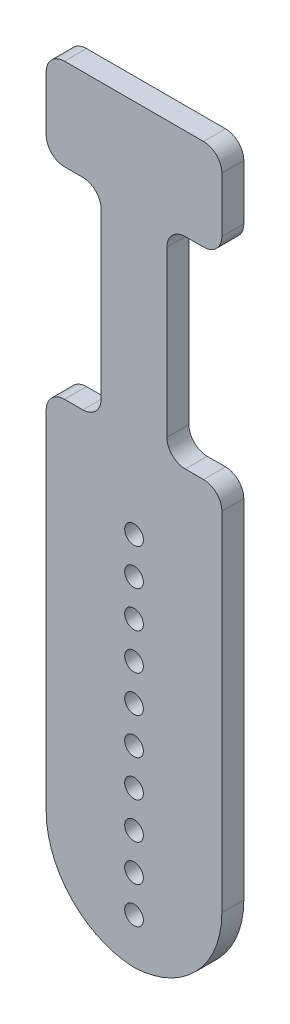
ISO-10303-21;
HEADER;
FILE_DESCRIPTION(('STEP AP214'),'2;1');
FILE_NAME('part.step','',(''),(''),'','','');
FILE_SCHEMA(('AUTOMOTIVE_DESIGN { 1 0 10303 214 1 1 1 1 }'));
ENDSEC;
DATA;
#1=APPLICATION_CONTEXT('core data for automotive mechanical design processes');
#2=APPLICATION_PROTOCOL_DEFINITION('international standard','automotive_design',2000,#1);
#3=PRODUCT_CONTEXT('',#1,'mechanical');
#4=PRODUCT('Part','Part','',(#3));
#5=PRODUCT_RELATED_PRODUCT_CATEGORY('part','',(#4));
#6=PRODUCT_DEFINITION_FORMATION('','',#4);
#7=PRODUCT_DEFINITION_CONTEXT('part definition',#1,'design');
#8=PRODUCT_DEFINITION('design','',#6,#7);
#9=PRODUCT_DEFINITION_SHAPE('','',#8);
#10=(LENGTH_UNIT() NAMED_UNIT(*) SI_UNIT(.MILLI.,.METRE.));
#11=(NAMED_UNIT(*) PLANE_ANGLE_UNIT() SI_UNIT($,.RADIAN.));
#12=(NAMED_UNIT(*) SI_UNIT($,.STERADIAN.) SOLID_ANGLE_UNIT());
#13=UNCERTAINTY_MEASURE_WITH_UNIT(LENGTH_MEASURE(1.E-05),#10,'distance_accuracy_value','');
#14=(GEOMETRIC_REPRESENTATION_CONTEXT(3) GLOBAL_UNCERTAINTY_ASSIGNED_CONTEXT((#13)) GLOBAL_UNIT_ASSIGNED_CONTEXT((#10,
#11,#12)) REPRESENTATION_CONTEXT('',''));
#15=CARTESIAN_POINT('',(0.,0.,0.));
#16=DIRECTION('',(0.,0.,1.));
#17=DIRECTION('',(1.,0.,0.));
#18=AXIS2_PLACEMENT_3D('',#15,#16,#17);
#19=CARTESIAN_POINT('',(24.,205.,-3.));
#20=DIRECTION('',(-1.,0.,0.));
#21=DIRECTION('',(0.,0.,1.));
#22=AXIS2_PLACEMENT_3D('',#19,#20,#21);
#23=PLANE('',#22);
#24=DIRECTION('',(0.,-1.,0.));
#25=VECTOR('',#24,1.);
#26=CARTESIAN_POINT('',(24.,205.,3.));
#27=LINE('',#26,#25);
#28=CARTESIAN_POINT('',(24.,200.,3.));
#29=VERTEX_POINT('',#28);
#30=CARTESIAN_POINT('',(24.,185.,3.));
#31=VERTEX_POINT('',#30);
#32=EDGE_CURVE('E211',#29,#31,#27,.T.);
#33=ORIENTED_EDGE('',*,*,#32,.T.);
#34=DIRECTION('',(0.,0.,1.));
#35=VECTOR('',#34,1.);
#36=CARTESIAN_POINT('',(24.,185.,-3.));
#37=LINE('',#36,#35);
#38=CARTESIAN_POINT('',(24.,185.,-3.));
#39=VERTEX_POINT('',#38);
#40=EDGE_CURVE('E410',#31,#39,#37,.F.);
#41=ORIENTED_EDGE('',*,*,#40,.T.);
#42=DIRECTION('',(0.,-1.,0.));
#43=VECTOR('',#42,1.);
#44=CARTESIAN_POINT('',(24.,205.,-3.));
#45=LINE('',#44,#43);
#46=CARTESIAN_POINT('',(24.,200.,-3.));
#47=VERTEX_POINT('',#46);
#48=EDGE_CURVE('E230',#47,#39,#45,.T.);
#49=ORIENTED_EDGE('',*,*,#48,.F.);
#50=DIRECTION('',(0.,0.,-1.));
#51=VECTOR('',#50,1.);
#52=CARTESIAN_POINT('',(24.,200.,3.));
#53=LINE('',#52,#51);
#54=EDGE_CURVE('E407',#47,#29,#53,.F.);
#55=ORIENTED_EDGE('',*,*,#54,.T.);
#56=EDGE_LOOP('',(#33,#41,#49,#55));
#57=FACE_BOUND('',#56,.T.);
#58=ADVANCED_FACE('F42',(#57),#23,.F.);
#59=CARTESIAN_POINT('',(-24.,205.,-3.));
#60=DIRECTION('',(0.,0.,1.));
#61=DIRECTION('',(1.,0.,0.));
#62=AXIS2_PLACEMENT_3D('',#59,#60,#61);
#63=PLANE('',#62);
#64=CARTESIAN_POINT('',(0.,102.5,-3.));
#65=DIRECTION('',(0.,0.,1.));
#66=DIRECTION('',(1.,0.,0.));
#67=AXIS2_PLACEMENT_3D('',#64,#65,#66);
#68=CIRCLE('',#67,2.55);
#69=CARTESIAN_POINT('',(2.55,102.5,-3.));
#70=VERTEX_POINT('',#69);
#71=EDGE_CURVE('E301',#70,#70,#68,.T.);
#72=ORIENTED_EDGE('',*,*,#71,.T.);
#73=EDGE_LOOP('',(#72));
#74=FACE_BOUND('',#73,.T.);
#75=CARTESIAN_POINT('',(0.,92.5,-3.));
#76=DIRECTION('',(0.,0.,1.));
#77=DIRECTION('',(1.,0.,0.));
#78=AXIS2_PLACEMENT_3D('',#75,#76,#77);
#79=CIRCLE('',#78,2.55);
#80=CARTESIAN_POINT('',(2.55,92.5,-3.));
#81=VERTEX_POINT('',#80);
#82=EDGE_CURVE('E293',#81,#81,#79,.T.);
#83=ORIENTED_EDGE('',*,*,#82,.T.);
#84=EDGE_LOOP('',(#83));
#85=FACE_BOUND('',#84,.T.);
#86=CARTESIAN_POINT('',(0.,82.5,-3.));
#87=DIRECTION('',(0.,0.,1.));
#88=DIRECTION('',(1.,0.,0.));
#89=AXIS2_PLACEMENT_3D('',#86,#87,#88);
#90=CIRCLE('',#89,2.55);
#91=CARTESIAN_POINT('',(2.55,82.5,-3.));
#92=VERTEX_POINT('',#91);
#93=EDGE_CURVE('E285',#92,#92,#90,.T.);
#94=ORIENTED_EDGE('',*,*,#93,.T.);
#95=EDGE_LOOP('',(#94));
#96=FACE_BOUND('',#95,.T.);
#97=CARTESIAN_POINT('',(0.,72.5,-3.));
#98=DIRECTION('',(0.,0.,1.));
#99=DIRECTION('',(1.,0.,0.));
#100=AXIS2_PLACEMENT_3D('',#97,#98,#99);
#101=CIRCLE('',#100,2.55);
#102=CARTESIAN_POINT('',(2.55,72.5,-3.));
#103=VERTEX_POINT('',#102);
#104=EDGE_CURVE('E277',#103,#103,#101,.T.);
#105=ORIENTED_EDGE('',*,*,#104,.T.);
#106=EDGE_LOOP('',(#105));
#107=FACE_BOUND('',#106,.T.);
#108=CARTESIAN_POINT('',(0.,62.5,-3.));
#109=DIRECTION('',(0.,0.,1.));
#110=DIRECTION('',(1.,0.,0.));
#111=AXIS2_PLACEMENT_3D('',#108,#109,#110);
#112=CIRCLE('',#111,2.55);
#113=CARTESIAN_POINT('',(2.55,62.5,-3.));
#114=VERTEX_POINT('',#113);
#115=EDGE_CURVE('E269',#114,#114,#112,.T.);
#116=ORIENTED_EDGE('',*,*,#115,.T.);
#117=EDGE_LOOP('',(#116));
#118=FACE_BOUND('',#117,.T.);
#119=CARTESIAN_POINT('',(0.,52.5,-3.));
#120=DIRECTION('',(0.,0.,1.));
#121=DIRECTION('',(1.,0.,0.));
#122=AXIS2_PLACEMENT_3D('',#119,#120,#121);
#123=CIRCLE('',#122,2.55);
#124=CARTESIAN_POINT('',(2.55,52.5,-3.));
#125=VERTEX_POINT('',#124);
#126=EDGE_CURVE('E261',#125,#125,#123,.T.);
#127=ORIENTED_EDGE('',*,*,#126,.T.);
#128=EDGE_LOOP('',(#127));
#129=FACE_BOUND('',#128,.T.);
#130=CARTESIAN_POINT('',(0.,42.5,-3.));
#131=DIRECTION('',(0.,0.,1.));
#132=DIRECTION('',(1.,0.,0.));
#133=AXIS2_PLACEMENT_3D('',#130,#131,#132);
#134=CIRCLE('',#133,2.55);
#135=CARTESIAN_POINT('',(2.55,42.5,-3.));
#136=VERTEX_POINT('',#135);
#137=EDGE_CURVE('E249',#136,#136,#134,.T.);
#138=ORIENTED_EDGE('',*,*,#137,.T.);
#139=EDGE_LOOP('',(#138));
#140=FACE_BOUND('',#139,.T.);
#141=CARTESIAN_POINT('',(0.,12.5,-3.));
#142=DIRECTION('',(0.,0.,1.));
#143=DIRECTION('',(1.,0.,0.));
#144=AXIS2_PLACEMENT_3D('',#141,#142,#143);
#145=CIRCLE('',#144,2.55);
#146=CARTESIAN_POINT('',(2.55,12.5,-3.));
#147=VERTEX_POINT('',#146);
#148=EDGE_CURVE('E253',#147,#147,#145,.T.);
#149=ORIENTED_EDGE('',*,*,#148,.T.);
#150=EDGE_LOOP('',(#149));
#151=FACE_BOUND('',#150,.T.);
#152=CARTESIAN_POINT('',(0.,32.5,-3.));
#153=DIRECTION('',(0.,0.,1.));
#154=DIRECTION('',(1.,0.,0.));
#155=AXIS2_PLACEMENT_3D('',#152,#153,#154);
#156=CIRCLE('',#155,2.55);
#157=CARTESIAN_POINT('',(2.55,32.5,-3.));
#158=VERTEX_POINT('',#157);
#159=EDGE_CURVE('E491',#158,#158,#156,.T.);
#160=ORIENTED_EDGE('',*,*,#159,.T.);
#161=EDGE_LOOP('',(#160));
#162=FACE_BOUND('',#161,.T.);
#163=CARTESIAN_POINT('',(0.,22.5,-3.));
#164=DIRECTION('',(0.,0.,1.));
#165=DIRECTION('',(1.,0.,0.));
#166=AXIS2_PLACEMENT_3D('',#163,#164,#165);
#167=CIRCLE('',#166,2.55);
#168=CARTESIAN_POINT('',(2.55,22.5,-3.));
#169=VERTEX_POINT('',#168);
#170=EDGE_CURVE('E459',#169,#169,#167,.T.);
#171=ORIENTED_EDGE('',*,*,#170,.T.);
#172=EDGE_LOOP('',(#171));
#173=FACE_BOUND('',#172,.T.);
#174=DIRECTION('',(0.,-1.,0.));
#175=VECTOR('',#174,1.);
#176=CARTESIAN_POINT('',(-24.,205.,-3.));
#177=LINE('',#176,#175);
#178=CARTESIAN_POINT('',(-24.,120.,-3.));
#179=VERTEX_POINT('',#178);
#180=CARTESIAN_POINT('',(-24.,25.,-3.));
#181=VERTEX_POINT('',#180);
#182=EDGE_CURVE('E227',#179,#181,#177,.T.);
#183=ORIENTED_EDGE('',*,*,#182,.F.);
#184=CARTESIAN_POINT('',(-19.,120.,-3.));
#185=DIRECTION('',(0.,0.,1.));
#186=DIRECTION('',(1.,0.,0.));
#187=AXIS2_PLACEMENT_3D('',#184,#185,#186);
#188=CIRCLE('',#187,5.);
#189=CARTESIAN_POINT('',(-19.,125.,-3.));
#190=VERTEX_POINT('',#189);
#191=EDGE_CURVE('E351',#179,#190,#188,.F.);
#192=ORIENTED_EDGE('',*,*,#191,.T.);
#193=DIRECTION('',(-1.,0.,0.));
#194=VECTOR('',#193,1.);
#195=CARTESIAN_POINT('',(0.,125.,-3.));
#196=LINE('',#195,#194);
#197=CARTESIAN_POINT('',(-14.,125.,-3.));
#198=VERTEX_POINT('',#197);
#199=EDGE_CURVE('E461',#198,#190,#196,.T.);
#200=ORIENTED_EDGE('',*,*,#199,.F.);
#201=CARTESIAN_POINT('',(-14.,130.,-3.));
#202=DIRECTION('',(0.,0.,1.));
#203=DIRECTION('',(1.,0.,0.));
#204=AXIS2_PLACEMENT_3D('',#201,#202,#203);
#205=CIRCLE('',#204,5.);
#206=CARTESIAN_POINT('',(-8.99999999999999,130.,-3.));
#207=VERTEX_POINT('',#206);
#208=EDGE_CURVE('E58',#198,#207,#205,.T.);
#209=ORIENTED_EDGE('',*,*,#208,.T.);
#210=DIRECTION('',(0.,-1.,0.));
#211=VECTOR('',#210,1.);
#212=CARTESIAN_POINT('',(-8.99999999999997,0.,-3.));
#213=LINE('',#212,#211);
#214=CARTESIAN_POINT('',(-8.99999999999999,175.,-3.));
#215=VERTEX_POINT('',#214);
#216=EDGE_CURVE('E449',#215,#207,#213,.T.);
#217=ORIENTED_EDGE('',*,*,#216,.F.);
#218=CARTESIAN_POINT('',(-14.,175.,-3.));
#219=DIRECTION('',(0.,0.,1.));
#220=DIRECTION('',(1.,0.,0.));
#221=AXIS2_PLACEMENT_3D('',#218,#219,#220);
#222=CIRCLE('',#221,5.);
#223=CARTESIAN_POINT('',(-14.,180.,-3.));
#224=VERTEX_POINT('',#223);
#225=EDGE_CURVE('E12',#215,#224,#222,.T.);
#226=ORIENTED_EDGE('',*,*,#225,.T.);
#227=DIRECTION('',(1.,0.,0.));
#228=VECTOR('',#227,1.);
#229=CARTESIAN_POINT('',(0.,180.,-3.));
#230=LINE('',#229,#228);
#231=CARTESIAN_POINT('',(-19.,180.,-3.));
#232=VERTEX_POINT('',#231);
#233=EDGE_CURVE('E447',#232,#224,#230,.T.);
#234=ORIENTED_EDGE('',*,*,#233,.F.);
#235=CARTESIAN_POINT('',(-19.,185.,-3.));
#236=DIRECTION('',(0.,0.,1.));
#237=DIRECTION('',(1.,0.,0.));
#238=AXIS2_PLACEMENT_3D('',#235,#236,#237);
#239=CIRCLE('',#238,5.);
#240=CARTESIAN_POINT('',(-24.,185.,-3.));
#241=VERTEX_POINT('',#240);
#242=EDGE_CURVE('E342',#232,#241,#239,.F.);
#243=ORIENTED_EDGE('',*,*,#242,.T.);
#244=CARTESIAN_POINT('',(-24.,200.,-3.));
#245=VERTEX_POINT('',#244);
#246=EDGE_CURVE('E519',#245,#241,#177,.T.);
#247=ORIENTED_EDGE('',*,*,#246,.F.);
#248=CARTESIAN_POINT('',(-19.,200.,-3.));
#249=DIRECTION('',(0.,0.,1.));
#250=DIRECTION('',(1.,0.,0.));
#251=AXIS2_PLACEMENT_3D('',#248,#249,#250);
#252=CIRCLE('',#251,5.);
#253=CARTESIAN_POINT('',(-19.,205.,-3.));
#254=VERTEX_POINT('',#253);
#255=EDGE_CURVE('E345',#245,#254,#252,.F.);
#256=ORIENTED_EDGE('',*,*,#255,.T.);
#257=DIRECTION('',(-1.,0.,0.));
#258=VECTOR('',#257,1.);
#259=CARTESIAN_POINT('',(-24.,205.,-3.));
#260=LINE('',#259,#258);
#261=CARTESIAN_POINT('',(19.,205.,-3.));
#262=VERTEX_POINT('',#261);
#263=EDGE_CURVE('E252',#262,#254,#260,.T.);
#264=ORIENTED_EDGE('',*,*,#263,.F.);
#265=CARTESIAN_POINT('',(19.,200.,-3.));
#266=DIRECTION('',(0.,0.,1.));
#267=DIRECTION('',(1.,0.,0.));
#268=AXIS2_PLACEMENT_3D('',#265,#266,#267);
#269=CIRCLE('',#268,5.);
#270=EDGE_CURVE('E336',#262,#47,#269,.F.);
#271=ORIENTED_EDGE('',*,*,#270,.T.);
#272=ORIENTED_EDGE('',*,*,#48,.T.);
#273=CARTESIAN_POINT('',(19.,185.,-3.));
#274=DIRECTION('',(0.,0.,1.));
#275=DIRECTION('',(1.,0.,0.));
#276=AXIS2_PLACEMENT_3D('',#273,#274,#275);
#277=CIRCLE('',#276,5.);
#278=CARTESIAN_POINT('',(19.,180.,-3.));
#279=VERTEX_POINT('',#278);
#280=EDGE_CURVE('E339',#39,#279,#277,.F.);
#281=ORIENTED_EDGE('',*,*,#280,.T.);
#282=DIRECTION('',(1.,0.,0.));
#283=VECTOR('',#282,1.);
#284=CARTESIAN_POINT('',(0.,180.,-3.));
#285=LINE('',#284,#283);
#286=CARTESIAN_POINT('',(14.,180.,-3.));
#287=VERTEX_POINT('',#286);
#288=EDGE_CURVE('E481',#287,#279,#285,.T.);
#289=ORIENTED_EDGE('',*,*,#288,.F.);
#290=CARTESIAN_POINT('',(14.,175.,-3.));
#291=DIRECTION('',(0.,0.,1.));
#292=DIRECTION('',(1.,0.,0.));
#293=AXIS2_PLACEMENT_3D('',#290,#291,#292);
#294=CIRCLE('',#293,5.);
#295=CARTESIAN_POINT('',(9.00000000000001,175.,-3.));
#296=VERTEX_POINT('',#295);
#297=EDGE_CURVE('E427',#287,#296,#294,.T.);
#298=ORIENTED_EDGE('',*,*,#297,.T.);
#299=DIRECTION('',(0.,-1.,0.));
#300=VECTOR('',#299,1.);
#301=CARTESIAN_POINT('',(9.00000000000003,0.,-3.));
#302=LINE('',#301,#300);
#303=CARTESIAN_POINT('',(9.00000000000001,130.,-3.));
#304=VERTEX_POINT('',#303);
#305=EDGE_CURVE('E485',#296,#304,#302,.T.);
#306=ORIENTED_EDGE('',*,*,#305,.T.);
#307=CARTESIAN_POINT('',(14.,130.,-3.));
#308=DIRECTION('',(0.,0.,1.));
#309=DIRECTION('',(1.,0.,0.));
#310=AXIS2_PLACEMENT_3D('',#307,#308,#309);
#311=CIRCLE('',#310,5.);
#312=CARTESIAN_POINT('',(14.,125.,-3.));
#313=VERTEX_POINT('',#312);
#314=EDGE_CURVE('E421',#304,#313,#311,.T.);
#315=ORIENTED_EDGE('',*,*,#314,.T.);
#316=DIRECTION('',(1.,0.,0.));
#317=VECTOR('',#316,1.);
#318=CARTESIAN_POINT('',(0.,125.,-3.));
#319=LINE('',#318,#317);
#320=CARTESIAN_POINT('',(19.,125.,-3.));
#321=VERTEX_POINT('',#320);
#322=EDGE_CURVE('E477',#313,#321,#319,.T.);
#323=ORIENTED_EDGE('',*,*,#322,.T.);
#324=CARTESIAN_POINT('',(19.,120.,-3.));
#325=DIRECTION('',(0.,0.,1.));
#326=DIRECTION('',(1.,0.,0.));
#327=AXIS2_PLACEMENT_3D('',#324,#325,#326);
#328=CIRCLE('',#327,5.);
#329=CARTESIAN_POINT('',(24.,120.,-3.));
#330=VERTEX_POINT('',#329);
#331=EDGE_CURVE('E348',#321,#330,#328,.F.);
#332=ORIENTED_EDGE('',*,*,#331,.T.);
#333=CARTESIAN_POINT('',(24.,25.,-3.));
#334=VERTEX_POINT('',#333);
#335=EDGE_CURVE('E236',#330,#334,#45,.T.);
#336=ORIENTED_EDGE('',*,*,#335,.T.);
#337=CARTESIAN_POINT('',(-1.,25.,-3.));
#338=DIRECTION('',(0.,0.,1.));
#339=DIRECTION('',(1.,0.,0.));
#340=AXIS2_PLACEMENT_3D('',#337,#338,#339);
#341=CIRCLE('',#340,25.);
#342=CARTESIAN_POINT('',(0.,0.0200080064064016,-3.));
#343=VERTEX_POINT('',#342);
#344=EDGE_CURVE('E222',#334,#343,#341,.F.);
#345=ORIENTED_EDGE('',*,*,#344,.T.);
#346=CARTESIAN_POINT('',(0.999999999999994,25.,-3.));
#347=DIRECTION('',(0.,0.,1.));
#348=DIRECTION('',(1.,0.,0.));
#349=AXIS2_PLACEMENT_3D('',#346,#347,#348);
#350=CIRCLE('',#349,25.);
#351=EDGE_CURVE('E242',#343,#181,#350,.F.);
#352=ORIENTED_EDGE('',*,*,#351,.T.);
#353=EDGE_LOOP('',(#183,#192,#200,#209,#217,#226,#234,#243,#247,#256,#264,#271,#272,#281,#289,
#298,#306,#315,#323,#332,#336,#345,#352));
#354=FACE_BOUND('',#353,.T.);
#355=ADVANCED_FACE('F446',(#74,#85,#96,#107,#118,#129,#140,#151,#162,#173,#354),#63,.F.);
#356=CARTESIAN_POINT('',(-24.,205.,-3.));
#357=DIRECTION('',(1.,0.,0.));
#358=DIRECTION('',(0.,0.,-1.));
#359=AXIS2_PLACEMENT_3D('',#356,#357,#358);
#360=PLANE('',#359);
#361=DIRECTION('',(0.,-1.,0.));
#362=VECTOR('',#361,1.);
#363=CARTESIAN_POINT('',(-24.,205.,3.));
#364=LINE('',#363,#362);
#365=CARTESIAN_POINT('',(-24.,200.,3.));
#366=VERTEX_POINT('',#365);
#367=CARTESIAN_POINT('',(-24.,185.,3.));
#368=VERTEX_POINT('',#367);
#369=EDGE_CURVE('E210',#366,#368,#364,.T.);
#370=ORIENTED_EDGE('',*,*,#369,.F.);
#371=DIRECTION('',(0.,0.,1.));
#372=VECTOR('',#371,1.);
#373=CARTESIAN_POINT('',(-24.,200.,-3.));
#374=LINE('',#373,#372);
#375=EDGE_CURVE('E404',#366,#245,#374,.F.);
#376=ORIENTED_EDGE('',*,*,#375,.T.);
#377=ORIENTED_EDGE('',*,*,#246,.T.);
#378=DIRECTION('',(0.,0.,1.));
#379=VECTOR('',#378,1.);
#380=CARTESIAN_POINT('',(-24.,185.,3.));
#381=LINE('',#380,#379);
#382=EDGE_CURVE('E400',#241,#368,#381,.T.);
#383=ORIENTED_EDGE('',*,*,#382,.T.);
#384=EDGE_LOOP('',(#370,#376,#377,#383));
#385=FACE_BOUND('',#384,.T.);
#386=ADVANCED_FACE('F585',(#385),#360,.F.);
#387=CARTESIAN_POINT('',(-24.,120.,3.));
#388=VERTEX_POINT('',#387);
#389=CARTESIAN_POINT('',(-24.,25.,3.));
#390=VERTEX_POINT('',#389);
#391=EDGE_CURVE('E198',#388,#390,#364,.T.);
#392=ORIENTED_EDGE('',*,*,#391,.F.);
#393=DIRECTION('',(0.,0.,1.));
#394=VECTOR('',#393,1.);
#395=CARTESIAN_POINT('',(-24.,120.,-3.));
#396=LINE('',#395,#394);
#397=EDGE_CURVE('E333',#388,#179,#396,.F.);
#398=ORIENTED_EDGE('',*,*,#397,.T.);
#399=ORIENTED_EDGE('',*,*,#182,.T.);
#400=DIRECTION('',(0.,0.,1.));
#401=VECTOR('',#400,1.);
#402=CARTESIAN_POINT('',(-24.,25.,-3.));
#403=LINE('',#402,#401);
#404=EDGE_CURVE('E218',#181,#390,#403,.T.);
#405=ORIENTED_EDGE('',*,*,#404,.T.);
#406=EDGE_LOOP('',(#392,#398,#399,#405));
#407=FACE_BOUND('',#406,.T.);
#408=ADVANCED_FACE('F225',(#407),#360,.F.);
#409=CARTESIAN_POINT('',(-24.,205.,3.));
#410=DIRECTION('',(0.,0.,-1.));
#411=DIRECTION('',(-1.,0.,0.));
#412=AXIS2_PLACEMENT_3D('',#409,#410,#411);
#413=PLANE('',#412);
#414=CARTESIAN_POINT('',(0.,102.5,3.));
#415=DIRECTION('',(0.,0.,1.));
#416=DIRECTION('',(1.,0.,0.));
#417=AXIS2_PLACEMENT_3D('',#414,#415,#416);
#418=CIRCLE('',#417,2.55);
#419=CARTESIAN_POINT('',(2.55,102.5,3.));
#420=VERTEX_POINT('',#419);
#421=EDGE_CURVE('E305',#420,#420,#418,.T.);
#422=ORIENTED_EDGE('',*,*,#421,.F.);
#423=EDGE_LOOP('',(#422));
#424=FACE_BOUND('',#423,.T.);
#425=CARTESIAN_POINT('',(0.,92.5,3.));
#426=DIRECTION('',(0.,0.,1.));
#427=DIRECTION('',(1.,0.,0.));
#428=AXIS2_PLACEMENT_3D('',#425,#426,#427);
#429=CIRCLE('',#428,2.55);
#430=CARTESIAN_POINT('',(2.55,92.5,3.));
#431=VERTEX_POINT('',#430);
#432=EDGE_CURVE('E297',#431,#431,#429,.T.);
#433=ORIENTED_EDGE('',*,*,#432,.F.);
#434=EDGE_LOOP('',(#433));
#435=FACE_BOUND('',#434,.T.);
#436=CARTESIAN_POINT('',(0.,82.5,3.));
#437=DIRECTION('',(0.,0.,1.));
#438=DIRECTION('',(1.,0.,0.));
#439=AXIS2_PLACEMENT_3D('',#436,#437,#438);
#440=CIRCLE('',#439,2.55);
#441=CARTESIAN_POINT('',(2.55,82.5,3.));
#442=VERTEX_POINT('',#441);
#443=EDGE_CURVE('E289',#442,#442,#440,.T.);
#444=ORIENTED_EDGE('',*,*,#443,.F.);
#445=EDGE_LOOP('',(#444));
#446=FACE_BOUND('',#445,.T.);
#447=CARTESIAN_POINT('',(0.,72.5,3.));
#448=DIRECTION('',(0.,0.,1.));
#449=DIRECTION('',(1.,0.,0.));
#450=AXIS2_PLACEMENT_3D('',#447,#448,#449);
#451=CIRCLE('',#450,2.55);
#452=CARTESIAN_POINT('',(2.55,72.5,3.));
#453=VERTEX_POINT('',#452);
#454=EDGE_CURVE('E281',#453,#453,#451,.T.);
#455=ORIENTED_EDGE('',*,*,#454,.F.);
#456=EDGE_LOOP('',(#455));
#457=FACE_BOUND('',#456,.T.);
#458=CARTESIAN_POINT('',(0.,62.5,3.));
#459=DIRECTION('',(0.,0.,1.));
#460=DIRECTION('',(1.,0.,0.));
#461=AXIS2_PLACEMENT_3D('',#458,#459,#460);
#462=CIRCLE('',#461,2.55);
#463=CARTESIAN_POINT('',(2.55,62.5,3.));
#464=VERTEX_POINT('',#463);
#465=EDGE_CURVE('E273',#464,#464,#462,.T.);
#466=ORIENTED_EDGE('',*,*,#465,.F.);
#467=EDGE_LOOP('',(#466));
#468=FACE_BOUND('',#467,.T.);
#469=CARTESIAN_POINT('',(0.,52.5,3.));
#470=DIRECTION('',(0.,0.,1.));
#471=DIRECTION('',(1.,0.,0.));
#472=AXIS2_PLACEMENT_3D('',#469,#470,#471);
#473=CIRCLE('',#472,2.55);
#474=CARTESIAN_POINT('',(2.55,52.5,3.));
#475=VERTEX_POINT('',#474);
#476=EDGE_CURVE('E265',#475,#475,#473,.T.);
#477=ORIENTED_EDGE('',*,*,#476,.F.);
#478=EDGE_LOOP('',(#477));
#479=FACE_BOUND('',#478,.T.);
#480=CARTESIAN_POINT('',(0.,42.5,3.));
#481=DIRECTION('',(0.,0.,1.));
#482=DIRECTION('',(1.,0.,0.));
#483=AXIS2_PLACEMENT_3D('',#480,#481,#482);
#484=CIRCLE('',#483,2.55);
#485=CARTESIAN_POINT('',(2.55,42.5,3.));
#486=VERTEX_POINT('',#485);
#487=EDGE_CURVE('E257',#486,#486,#484,.T.);
#488=ORIENTED_EDGE('',*,*,#487,.F.);
#489=EDGE_LOOP('',(#488));
#490=FACE_BOUND('',#489,.T.);
#491=CARTESIAN_POINT('',(0.,12.5,3.));
#492=DIRECTION('',(0.,0.,1.));
#493=DIRECTION('',(1.,0.,0.));
#494=AXIS2_PLACEMENT_3D('',#491,#492,#493);
#495=CIRCLE('',#494,2.55);
#496=CARTESIAN_POINT('',(2.55,12.5,3.));
#497=VERTEX_POINT('',#496);
#498=EDGE_CURVE('E500',#497,#497,#495,.T.);
#499=ORIENTED_EDGE('',*,*,#498,.F.);
#500=EDGE_LOOP('',(#499));
#501=FACE_BOUND('',#500,.T.);
#502=CARTESIAN_POINT('',(0.,32.5,3.));
#503=DIRECTION('',(0.,0.,1.));
#504=DIRECTION('',(1.,0.,0.));
#505=AXIS2_PLACEMENT_3D('',#502,#503,#504);
#506=CIRCLE('',#505,2.55);
#507=CARTESIAN_POINT('',(2.55,32.5,3.));
#508=VERTEX_POINT('',#507);
#509=EDGE_CURVE('E496',#508,#508,#506,.T.);
#510=ORIENTED_EDGE('',*,*,#509,.F.);
#511=EDGE_LOOP('',(#510));
#512=FACE_BOUND('',#511,.T.);
#513=CARTESIAN_POINT('',(0.,22.5,3.));
#514=DIRECTION('',(0.,0.,1.));
#515=DIRECTION('',(1.,0.,0.));
#516=AXIS2_PLACEMENT_3D('',#513,#514,#515);
#517=CIRCLE('',#516,2.55);
#518=CARTESIAN_POINT('',(2.55,22.5,3.));
#519=VERTEX_POINT('',#518);
#520=EDGE_CURVE('E454',#519,#519,#517,.T.);
#521=ORIENTED_EDGE('',*,*,#520,.F.);
#522=EDGE_LOOP('',(#521));
#523=FACE_BOUND('',#522,.T.);
#524=DIRECTION('',(-1.,0.,0.));
#525=VECTOR('',#524,1.);
#526=CARTESIAN_POINT('',(0.,125.,3.));
#527=LINE('',#526,#525);
#528=CARTESIAN_POINT('',(-14.,125.,3.));
#529=VERTEX_POINT('',#528);
#530=CARTESIAN_POINT('',(-19.,125.,3.));
#531=VERTEX_POINT('',#530);
#532=EDGE_CURVE('E440',#529,#531,#527,.T.);
#533=ORIENTED_EDGE('',*,*,#532,.T.);
#534=CARTESIAN_POINT('',(-19.,120.,3.));
#535=DIRECTION('',(0.,0.,-1.));
#536=DIRECTION('',(-1.,0.,0.));
#537=AXIS2_PLACEMENT_3D('',#534,#535,#536);
#538=CIRCLE('',#537,5.);
#539=EDGE_CURVE('E205',#531,#388,#538,.F.);
#540=ORIENTED_EDGE('',*,*,#539,.T.);
#541=ORIENTED_EDGE('',*,*,#391,.T.);
#542=CARTESIAN_POINT('',(0.999999999999994,25.,3.));
#543=DIRECTION('',(0.,0.,-1.));
#544=DIRECTION('',(-1.,0.,0.));
#545=AXIS2_PLACEMENT_3D('',#542,#543,#544);
#546=CIRCLE('',#545,25.);
#547=CARTESIAN_POINT('',(0.,0.0200080064064016,3.));
#548=VERTEX_POINT('',#547);
#549=EDGE_CURVE('E203',#390,#548,#546,.F.);
#550=ORIENTED_EDGE('',*,*,#549,.T.);
#551=CARTESIAN_POINT('',(-1.,25.,3.));
#552=DIRECTION('',(0.,0.,-1.));
#553=DIRECTION('',(-1.,0.,0.));
#554=AXIS2_PLACEMENT_3D('',#551,#552,#553);
#555=CIRCLE('',#554,25.);
#556=CARTESIAN_POINT('',(24.,25.,3.));
#557=VERTEX_POINT('',#556);
#558=EDGE_CURVE('E223',#548,#557,#555,.F.);
#559=ORIENTED_EDGE('',*,*,#558,.T.);
#560=CARTESIAN_POINT('',(24.,120.,3.));
#561=VERTEX_POINT('',#560);
#562=EDGE_CURVE('E514',#561,#557,#27,.T.);
#563=ORIENTED_EDGE('',*,*,#562,.F.);
#564=CARTESIAN_POINT('',(19.,120.,3.));
#565=DIRECTION('',(0.,0.,-1.));
#566=DIRECTION('',(-1.,0.,0.));
#567=AXIS2_PLACEMENT_3D('',#564,#565,#566);
#568=CIRCLE('',#567,5.);
#569=CARTESIAN_POINT('',(19.,125.,3.));
#570=VERTEX_POINT('',#569);
#571=EDGE_CURVE('E328',#561,#570,#568,.F.);
#572=ORIENTED_EDGE('',*,*,#571,.T.);
#573=DIRECTION('',(1.,0.,0.));
#574=VECTOR('',#573,1.);
#575=CARTESIAN_POINT('',(0.,125.,3.));
#576=LINE('',#575,#574);
#577=CARTESIAN_POINT('',(14.,125.,3.));
#578=VERTEX_POINT('',#577);
#579=EDGE_CURVE('E465',#578,#570,#576,.T.);
#580=ORIENTED_EDGE('',*,*,#579,.F.);
#581=CARTESIAN_POINT('',(14.,130.,3.));
#582=DIRECTION('',(0.,0.,-1.));
#583=DIRECTION('',(-1.,0.,0.));
#584=AXIS2_PLACEMENT_3D('',#581,#582,#583);
#585=CIRCLE('',#584,5.);
#586=CARTESIAN_POINT('',(9.00000000000001,130.,3.));
#587=VERTEX_POINT('',#586);
#588=EDGE_CURVE('E418',#578,#587,#585,.T.);
#589=ORIENTED_EDGE('',*,*,#588,.T.);
#590=DIRECTION('',(0.,-1.,0.));
#591=VECTOR('',#590,1.);
#592=CARTESIAN_POINT('',(9.00000000000003,0.,3.));
#593=LINE('',#592,#591);
#594=CARTESIAN_POINT('',(9.00000000000001,175.,3.));
#595=VERTEX_POINT('',#594);
#596=EDGE_CURVE('E473',#595,#587,#593,.T.);
#597=ORIENTED_EDGE('',*,*,#596,.F.);
#598=CARTESIAN_POINT('',(14.,175.,3.));
#599=DIRECTION('',(0.,0.,-1.));
#600=DIRECTION('',(-1.,0.,0.));
#601=AXIS2_PLACEMENT_3D('',#598,#599,#600);
#602=CIRCLE('',#601,5.);
#603=CARTESIAN_POINT('',(14.,180.,3.));
#604=VERTEX_POINT('',#603);
#605=EDGE_CURVE('E424',#595,#604,#602,.T.);
#606=ORIENTED_EDGE('',*,*,#605,.T.);
#607=DIRECTION('',(1.,0.,0.));
#608=VECTOR('',#607,1.);
#609=CARTESIAN_POINT('',(0.,180.,3.));
#610=LINE('',#609,#608);
#611=CARTESIAN_POINT('',(19.,180.,3.));
#612=VERTEX_POINT('',#611);
#613=EDGE_CURVE('E469',#604,#612,#610,.T.);
#614=ORIENTED_EDGE('',*,*,#613,.T.);
#615=CARTESIAN_POINT('',(19.,185.,3.));
#616=DIRECTION('',(0.,0.,-1.));
#617=DIRECTION('',(-1.,0.,0.));
#618=AXIS2_PLACEMENT_3D('',#615,#616,#617);
#619=CIRCLE('',#618,5.);
#620=EDGE_CURVE('E319',#612,#31,#619,.F.);
#621=ORIENTED_EDGE('',*,*,#620,.T.);
#622=ORIENTED_EDGE('',*,*,#32,.F.);
#623=CARTESIAN_POINT('',(19.,200.,3.));
#624=DIRECTION('',(0.,0.,-1.));
#625=DIRECTION('',(-1.,0.,0.));
#626=AXIS2_PLACEMENT_3D('',#623,#624,#625);
#627=CIRCLE('',#626,5.);
#628=CARTESIAN_POINT('',(19.,205.,3.));
#629=VERTEX_POINT('',#628);
#630=EDGE_CURVE('E316',#29,#629,#627,.F.);
#631=ORIENTED_EDGE('',*,*,#630,.T.);
#632=DIRECTION('',(1.,0.,0.));
#633=VECTOR('',#632,1.);
#634=CARTESIAN_POINT('',(-24.,205.,3.));
#635=LINE('',#634,#633);
#636=CARTESIAN_POINT('',(-19.,205.,3.));
#637=VERTEX_POINT('',#636);
#638=EDGE_CURVE('E510',#637,#629,#635,.T.);
#639=ORIENTED_EDGE('',*,*,#638,.F.);
#640=CARTESIAN_POINT('',(-19.,200.,3.));
#641=DIRECTION('',(0.,0.,-1.));
#642=DIRECTION('',(-1.,0.,0.));
#643=AXIS2_PLACEMENT_3D('',#640,#641,#642);
#644=CIRCLE('',#643,5.);
#645=EDGE_CURVE('E325',#637,#366,#644,.F.);
#646=ORIENTED_EDGE('',*,*,#645,.T.);
#647=ORIENTED_EDGE('',*,*,#369,.T.);
#648=CARTESIAN_POINT('',(-19.,185.,3.));
#649=DIRECTION('',(0.,0.,-1.));
#650=DIRECTION('',(-1.,0.,0.));
#651=AXIS2_PLACEMENT_3D('',#648,#649,#650);
#652=CIRCLE('',#651,5.);
#653=CARTESIAN_POINT('',(-19.,180.,3.));
#654=VERTEX_POINT('',#653);
#655=EDGE_CURVE('E322',#368,#654,#652,.F.);
#656=ORIENTED_EDGE('',*,*,#655,.T.);
#657=DIRECTION('',(1.,0.,0.));
#658=VECTOR('',#657,1.);
#659=CARTESIAN_POINT('',(0.,180.,3.));
#660=LINE('',#659,#658);
#661=CARTESIAN_POINT('',(-14.,180.,3.));
#662=VERTEX_POINT('',#661);
#663=EDGE_CURVE('E434',#654,#662,#660,.T.);
#664=ORIENTED_EDGE('',*,*,#663,.T.);
#665=CARTESIAN_POINT('',(-14.,175.,3.));
#666=DIRECTION('',(0.,0.,-1.));
#667=DIRECTION('',(-1.,0.,0.));
#668=AXIS2_PLACEMENT_3D('',#665,#666,#667);
#669=CIRCLE('',#668,5.);
#670=CARTESIAN_POINT('',(-8.99999999999999,175.,3.));
#671=VERTEX_POINT('',#670);
#672=EDGE_CURVE('E51',#662,#671,#669,.T.);
#673=ORIENTED_EDGE('',*,*,#672,.T.);
#674=DIRECTION('',(0.,-1.,0.));
#675=VECTOR('',#674,1.);
#676=CARTESIAN_POINT('',(-8.99999999999997,0.,3.));
#677=LINE('',#676,#675);
#678=CARTESIAN_POINT('',(-8.99999999999999,130.,3.));
#679=VERTEX_POINT('',#678);
#680=EDGE_CURVE('E432',#671,#679,#677,.T.);
#681=ORIENTED_EDGE('',*,*,#680,.T.);
#682=CARTESIAN_POINT('',(-14.,130.,3.));
#683=DIRECTION('',(0.,0.,-1.));
#684=DIRECTION('',(-1.,0.,0.));
#685=AXIS2_PLACEMENT_3D('',#682,#683,#684);
#686=CIRCLE('',#685,5.);
#687=EDGE_CURVE('E413',#679,#529,#686,.T.);
#688=ORIENTED_EDGE('',*,*,#687,.T.);
#689=EDGE_LOOP('',(#533,#540,#541,#550,#559,#563,#572,#580,#589,#597,#606,#614,#621,#622,#631,
#639,#646,#647,#656,#664,#673,#681,#688));
#690=FACE_BOUND('',#689,.T.);
#691=ADVANCED_FACE('F201',(#424,#435,#446,#457,#468,#479,#490,#501,#512,#523,#690),#413,.F.);
#692=CARTESIAN_POINT('',(0.,102.5,-3.));
#693=DIRECTION('',(0.,0.,1.));
#694=DIRECTION('',(1.,0.,0.));
#695=AXIS2_PLACEMENT_3D('',#692,#693,#694);
#696=CYLINDRICAL_SURFACE('',#695,2.55);
#697=ORIENTED_EDGE('',*,*,#71,.F.);
#698=EDGE_LOOP('',(#697));
#699=FACE_BOUND('',#698,.T.);
#700=ORIENTED_EDGE('',*,*,#421,.T.);
#701=EDGE_LOOP('',(#700));
#702=FACE_BOUND('',#701,.T.);
#703=ADVANCED_FACE('F653',(#699,#702),#696,.F.);
#704=CARTESIAN_POINT('',(0.,92.5,-3.));
#705=DIRECTION('',(0.,0.,1.));
#706=DIRECTION('',(1.,0.,0.));
#707=AXIS2_PLACEMENT_3D('',#704,#705,#706);
#708=CYLINDRICAL_SURFACE('',#707,2.55);
#709=ORIENTED_EDGE('',*,*,#82,.F.);
#710=EDGE_LOOP('',(#709));
#711=FACE_BOUND('',#710,.T.);
#712=ORIENTED_EDGE('',*,*,#432,.T.);
#713=EDGE_LOOP('',(#712));
#714=FACE_BOUND('',#713,.T.);
#715=ADVANCED_FACE('F649',(#711,#714),#708,.F.);
#716=CARTESIAN_POINT('',(0.,82.5,-3.));
#717=DIRECTION('',(0.,0.,1.));
#718=DIRECTION('',(1.,0.,0.));
#719=AXIS2_PLACEMENT_3D('',#716,#717,#718);
#720=CYLINDRICAL_SURFACE('',#719,2.55);
#721=ORIENTED_EDGE('',*,*,#93,.F.);
#722=EDGE_LOOP('',(#721));
#723=FACE_BOUND('',#722,.T.);
#724=ORIENTED_EDGE('',*,*,#443,.T.);
#725=EDGE_LOOP('',(#724));
#726=FACE_BOUND('',#725,.T.);
#727=ADVANCED_FACE('F645',(#723,#726),#720,.F.);
#728=CARTESIAN_POINT('',(0.,72.5,-3.));
#729=DIRECTION('',(0.,0.,1.));
#730=DIRECTION('',(1.,0.,0.));
#731=AXIS2_PLACEMENT_3D('',#728,#729,#730);
#732=CYLINDRICAL_SURFACE('',#731,2.55);
#733=ORIENTED_EDGE('',*,*,#104,.F.);
#734=EDGE_LOOP('',(#733));
#735=FACE_BOUND('',#734,.T.);
#736=ORIENTED_EDGE('',*,*,#454,.T.);
#737=EDGE_LOOP('',(#736));
#738=FACE_BOUND('',#737,.T.);
#739=ADVANCED_FACE('F641',(#735,#738),#732,.F.);
#740=CARTESIAN_POINT('',(0.,62.5,-3.));
#741=DIRECTION('',(0.,0.,1.));
#742=DIRECTION('',(1.,0.,0.));
#743=AXIS2_PLACEMENT_3D('',#740,#741,#742);
#744=CYLINDRICAL_SURFACE('',#743,2.55);
#745=ORIENTED_EDGE('',*,*,#115,.F.);
#746=EDGE_LOOP('',(#745));
#747=FACE_BOUND('',#746,.T.);
#748=ORIENTED_EDGE('',*,*,#465,.T.);
#749=EDGE_LOOP('',(#748));
#750=FACE_BOUND('',#749,.T.);
#751=ADVANCED_FACE('F632',(#747,#750),#744,.F.);
#752=CARTESIAN_POINT('',(0.,52.5,-3.));
#753=DIRECTION('',(0.,0.,1.));
#754=DIRECTION('',(1.,0.,0.));
#755=AXIS2_PLACEMENT_3D('',#752,#753,#754);
#756=CYLINDRICAL_SURFACE('',#755,2.55);
#757=ORIENTED_EDGE('',*,*,#126,.F.);
#758=EDGE_LOOP('',(#757));
#759=FACE_BOUND('',#758,.T.);
#760=ORIENTED_EDGE('',*,*,#476,.T.);
#761=EDGE_LOOP('',(#760));
#762=FACE_BOUND('',#761,.T.);
#763=ADVANCED_FACE('F626',(#759,#762),#756,.F.);
#764=CARTESIAN_POINT('',(0.,42.5,-3.));
#765=DIRECTION('',(0.,0.,1.));
#766=DIRECTION('',(1.,0.,0.));
#767=AXIS2_PLACEMENT_3D('',#764,#765,#766);
#768=CYLINDRICAL_SURFACE('',#767,2.55);
#769=ORIENTED_EDGE('',*,*,#137,.F.);
#770=EDGE_LOOP('',(#769));
#771=FACE_BOUND('',#770,.T.);
#772=ORIENTED_EDGE('',*,*,#487,.T.);
#773=EDGE_LOOP('',(#772));
#774=FACE_BOUND('',#773,.T.);
#775=ADVANCED_FACE('F620',(#771,#774),#768,.F.);
#776=ORIENTED_EDGE('',*,*,#335,.F.);
#777=DIRECTION('',(0.,0.,1.));
#778=VECTOR('',#777,1.);
#779=CARTESIAN_POINT('',(24.,120.,-3.));
#780=LINE('',#779,#778);
#781=EDGE_CURVE('E360',#330,#561,#780,.T.);
#782=ORIENTED_EDGE('',*,*,#781,.T.);
#783=ORIENTED_EDGE('',*,*,#562,.T.);
#784=DIRECTION('',(0.,0.,-1.));
#785=VECTOR('',#784,1.);
#786=CARTESIAN_POINT('',(24.,25.,-3.));
#787=LINE('',#786,#785);
#788=EDGE_CURVE('E245',#557,#334,#787,.T.);
#789=ORIENTED_EDGE('',*,*,#788,.T.);
#790=EDGE_LOOP('',(#776,#782,#783,#789));
#791=FACE_BOUND('',#790,.T.);
#792=ADVANCED_FACE('F531',(#791),#23,.F.);
#793=CARTESIAN_POINT('',(0.,205.,0.));
#794=DIRECTION('',(0.,1.,0.));
#795=DIRECTION('',(0.,0.,1.));
#796=AXIS2_PLACEMENT_3D('',#793,#794,#795);
#797=PLANE('',#796);
#798=ORIENTED_EDGE('',*,*,#263,.T.);
#799=DIRECTION('',(0.,0.,1.));
#800=VECTOR('',#799,1.);
#801=CARTESIAN_POINT('',(-19.,205.,3.));
#802=LINE('',#801,#800);
#803=EDGE_CURVE('E396',#254,#637,#802,.T.);
#804=ORIENTED_EDGE('',*,*,#803,.T.);
#805=ORIENTED_EDGE('',*,*,#638,.T.);
#806=DIRECTION('',(0.,0.,-1.));
#807=VECTOR('',#806,1.);
#808=CARTESIAN_POINT('',(19.,205.,-3.));
#809=LINE('',#808,#807);
#810=EDGE_CURVE('E392',#629,#262,#809,.T.);
#811=ORIENTED_EDGE('',*,*,#810,.T.);
#812=EDGE_LOOP('',(#798,#804,#805,#811));
#813=FACE_BOUND('',#812,.T.);
#814=ADVANCED_FACE('F577',(#813),#797,.T.);
#815=CARTESIAN_POINT('',(-1.,25.,-3.));
#816=DIRECTION('',(0.,0.,-1.));
#817=DIRECTION('',(-1.,0.,0.));
#818=AXIS2_PLACEMENT_3D('',#815,#816,#817);
#819=CYLINDRICAL_SURFACE('',#818,25.);
#820=DIRECTION('',(0.,0.,-1.));
#821=VECTOR('',#820,1.);
#822=CARTESIAN_POINT('',(0.,0.0200080064064016,0.));
#823=LINE('',#822,#821);
#824=EDGE_CURVE('E220',#343,#548,#823,.F.);
#825=ORIENTED_EDGE('',*,*,#824,.F.);
#826=ORIENTED_EDGE('',*,*,#344,.F.);
#827=ORIENTED_EDGE('',*,*,#788,.F.);
#828=ORIENTED_EDGE('',*,*,#558,.F.);
#829=EDGE_LOOP('',(#825,#826,#827,#828));
#830=FACE_BOUND('',#829,.T.);
#831=ADVANCED_FACE('F536',(#830),#819,.T.);
#832=CARTESIAN_POINT('',(0.999999999999994,25.,-3.));
#833=DIRECTION('',(0.,0.,1.));
#834=DIRECTION('',(1.,0.,0.));
#835=AXIS2_PLACEMENT_3D('',#832,#833,#834);
#836=CYLINDRICAL_SURFACE('',#835,25.);
#837=ORIENTED_EDGE('',*,*,#351,.F.);
#838=ORIENTED_EDGE('',*,*,#824,.T.);
#839=ORIENTED_EDGE('',*,*,#549,.F.);
#840=ORIENTED_EDGE('',*,*,#404,.F.);
#841=EDGE_LOOP('',(#837,#838,#839,#840));
#842=FACE_BOUND('',#841,.T.);
#843=ADVANCED_FACE('F217',(#842),#836,.T.);
#844=CARTESIAN_POINT('',(0.,12.5,-3.));
#845=DIRECTION('',(0.,0.,1.));
#846=DIRECTION('',(1.,0.,0.));
#847=AXIS2_PLACEMENT_3D('',#844,#845,#846);
#848=CYLINDRICAL_SURFACE('',#847,2.55);
#849=ORIENTED_EDGE('',*,*,#148,.F.);
#850=EDGE_LOOP('',(#849));
#851=FACE_BOUND('',#850,.T.);
#852=ORIENTED_EDGE('',*,*,#498,.T.);
#853=EDGE_LOOP('',(#852));
#854=FACE_BOUND('',#853,.T.);
#855=ADVANCED_FACE('F694',(#851,#854),#848,.F.);
#856=CARTESIAN_POINT('',(0.,32.5,-3.));
#857=DIRECTION('',(0.,0.,1.));
#858=DIRECTION('',(1.,0.,0.));
#859=AXIS2_PLACEMENT_3D('',#856,#857,#858);
#860=CYLINDRICAL_SURFACE('',#859,2.55);
#861=ORIENTED_EDGE('',*,*,#159,.F.);
#862=EDGE_LOOP('',(#861));
#863=FACE_BOUND('',#862,.T.);
#864=ORIENTED_EDGE('',*,*,#509,.T.);
#865=EDGE_LOOP('',(#864));
#866=FACE_BOUND('',#865,.T.);
#867=ADVANCED_FACE('F686',(#863,#866),#860,.F.);
#868=CARTESIAN_POINT('',(0.,22.5,-3.));
#869=DIRECTION('',(0.,0.,1.));
#870=DIRECTION('',(1.,0.,0.));
#871=AXIS2_PLACEMENT_3D('',#868,#869,#870);
#872=CYLINDRICAL_SURFACE('',#871,2.55);
#873=ORIENTED_EDGE('',*,*,#170,.F.);
#874=EDGE_LOOP('',(#873));
#875=FACE_BOUND('',#874,.T.);
#876=ORIENTED_EDGE('',*,*,#520,.T.);
#877=EDGE_LOOP('',(#876));
#878=FACE_BOUND('',#877,.T.);
#879=ADVANCED_FACE('F684',(#875,#878),#872,.F.);
#880=CARTESIAN_POINT('',(0.,125.,-3.));
#881=DIRECTION('',(0.,-1.,0.));
#882=DIRECTION('',(0.,0.,-1.));
#883=AXIS2_PLACEMENT_3D('',#880,#881,#882);
#884=PLANE('',#883);
#885=ORIENTED_EDGE('',*,*,#579,.T.);
#886=DIRECTION('',(0.,0.,1.));
#887=VECTOR('',#886,1.);
#888=CARTESIAN_POINT('',(19.,125.,-3.));
#889=LINE('',#888,#887);
#890=EDGE_CURVE('E368',#570,#321,#889,.F.);
#891=ORIENTED_EDGE('',*,*,#890,.T.);
#892=ORIENTED_EDGE('',*,*,#322,.F.);
#893=DIRECTION('',(0.,0.,1.));
#894=VECTOR('',#893,1.);
#895=CARTESIAN_POINT('',(14.,125.,3.));
#896=LINE('',#895,#894);
#897=EDGE_CURVE('E364',#313,#578,#896,.T.);
#898=ORIENTED_EDGE('',*,*,#897,.T.);
#899=EDGE_LOOP('',(#885,#891,#892,#898));
#900=FACE_BOUND('',#899,.T.);
#901=ADVANCED_FACE('F543',(#900),#884,.F.);
#902=CARTESIAN_POINT('',(9.00000000000003,0.,-3.));
#903=DIRECTION('',(-1.,0.,0.));
#904=DIRECTION('',(0.,-1.,0.));
#905=AXIS2_PLACEMENT_3D('',#902,#903,#904);
#906=PLANE('',#905);
#907=ORIENTED_EDGE('',*,*,#596,.T.);
#908=DIRECTION('',(0.,0.,1.));
#909=VECTOR('',#908,1.);
#910=CARTESIAN_POINT('',(9.00000000000001,130.,-3.));
#911=LINE('',#910,#909);
#912=EDGE_CURVE('E375',#587,#304,#911,.F.);
#913=ORIENTED_EDGE('',*,*,#912,.T.);
#914=ORIENTED_EDGE('',*,*,#305,.F.);
#915=DIRECTION('',(0.,0.,1.));
#916=VECTOR('',#915,1.);
#917=CARTESIAN_POINT('',(9.00000000000001,175.,-3.));
#918=LINE('',#917,#916);
#919=EDGE_CURVE('E371',#296,#595,#918,.T.);
#920=ORIENTED_EDGE('',*,*,#919,.T.);
#921=EDGE_LOOP('',(#907,#913,#914,#920));
#922=FACE_BOUND('',#921,.T.);
#923=ADVANCED_FACE('F552',(#922),#906,.F.);
#924=CARTESIAN_POINT('',(0.,180.,-3.));
#925=DIRECTION('',(0.,-1.,0.));
#926=DIRECTION('',(0.,0.,-1.));
#927=AXIS2_PLACEMENT_3D('',#924,#925,#926);
#928=PLANE('',#927);
#929=ORIENTED_EDGE('',*,*,#613,.F.);
#930=DIRECTION('',(0.,0.,1.));
#931=VECTOR('',#930,1.);
#932=CARTESIAN_POINT('',(14.,180.,-3.));
#933=LINE('',#932,#931);
#934=EDGE_CURVE('E382',#604,#287,#933,.F.);
#935=ORIENTED_EDGE('',*,*,#934,.T.);
#936=ORIENTED_EDGE('',*,*,#288,.T.);
#937=DIRECTION('',(0.,0.,1.));
#938=VECTOR('',#937,1.);
#939=CARTESIAN_POINT('',(19.,180.,3.));
#940=LINE('',#939,#938);
#941=EDGE_CURVE('E378',#279,#612,#940,.T.);
#942=ORIENTED_EDGE('',*,*,#941,.T.);
#943=EDGE_LOOP('',(#929,#935,#936,#942));
#944=FACE_BOUND('',#943,.T.);
#945=ADVANCED_FACE('F561',(#944),#928,.T.);
#946=CARTESIAN_POINT('',(0.,180.,-3.));
#947=DIRECTION('',(0.,-1.,0.));
#948=DIRECTION('',(0.,0.,-1.));
#949=AXIS2_PLACEMENT_3D('',#946,#947,#948);
#950=PLANE('',#949);
#951=ORIENTED_EDGE('',*,*,#233,.T.);
#952=DIRECTION('',(0.,0.,1.));
#953=VECTOR('',#952,1.);
#954=CARTESIAN_POINT('',(-14.,180.,3.));
#955=LINE('',#954,#953);
#956=EDGE_CURVE('E388',#224,#662,#955,.T.);
#957=ORIENTED_EDGE('',*,*,#956,.T.);
#958=ORIENTED_EDGE('',*,*,#663,.F.);
#959=DIRECTION('',(0.,0.,1.));
#960=VECTOR('',#959,1.);
#961=CARTESIAN_POINT('',(-19.,180.,-3.));
#962=LINE('',#961,#960);
#963=EDGE_CURVE('E385',#654,#232,#962,.F.);
#964=ORIENTED_EDGE('',*,*,#963,.T.);
#965=EDGE_LOOP('',(#951,#957,#958,#964));
#966=FACE_BOUND('',#965,.T.);
#967=ADVANCED_FACE('F451',(#966),#950,.T.);
#968=CARTESIAN_POINT('',(-8.99999999999997,0.,-3.));
#969=DIRECTION('',(-1.,0.,0.));
#970=DIRECTION('',(0.,-1.,0.));
#971=AXIS2_PLACEMENT_3D('',#968,#969,#970);
#972=PLANE('',#971);
#973=ORIENTED_EDGE('',*,*,#216,.T.);
#974=DIRECTION('',(0.,0.,1.));
#975=VECTOR('',#974,1.);
#976=CARTESIAN_POINT('',(-8.99999999999999,130.,3.));
#977=LINE('',#976,#975);
#978=EDGE_CURVE('E356',#207,#679,#977,.T.);
#979=ORIENTED_EDGE('',*,*,#978,.T.);
#980=ORIENTED_EDGE('',*,*,#680,.F.);
#981=DIRECTION('',(0.,0.,1.));
#982=VECTOR('',#981,1.);
#983=CARTESIAN_POINT('',(-8.99999999999999,175.,-3.));
#984=LINE('',#983,#982);
#985=EDGE_CURVE('E65',#671,#215,#984,.F.);
#986=ORIENTED_EDGE('',*,*,#985,.T.);
#987=EDGE_LOOP('',(#973,#979,#980,#986));
#988=FACE_BOUND('',#987,.T.);
#989=ADVANCED_FACE('F437',(#988),#972,.T.);
#990=CARTESIAN_POINT('',(0.,125.,-3.));
#991=DIRECTION('',(0.,1.,0.));
#992=DIRECTION('',(0.,0.,1.));
#993=AXIS2_PLACEMENT_3D('',#990,#991,#992);
#994=PLANE('',#993);
#995=ORIENTED_EDGE('',*,*,#199,.T.);
#996=DIRECTION('',(0.,0.,1.));
#997=VECTOR('',#996,1.);
#998=CARTESIAN_POINT('',(-19.,125.,3.));
#999=LINE('',#998,#997);
#1000=EDGE_CURVE('E312',#190,#531,#999,.T.);
#1001=ORIENTED_EDGE('',*,*,#1000,.T.);
#1002=ORIENTED_EDGE('',*,*,#532,.F.);
#1003=DIRECTION('',(0.,0.,1.));
#1004=VECTOR('',#1003,1.);
#1005=CARTESIAN_POINT('',(-14.,125.,-3.));
#1006=LINE('',#1005,#1004);
#1007=EDGE_CURVE('E309',#529,#198,#1006,.F.);
#1008=ORIENTED_EDGE('',*,*,#1007,.T.);
#1009=EDGE_LOOP('',(#995,#1001,#1002,#1008));
#1010=FACE_BOUND('',#1009,.T.);
#1011=ADVANCED_FACE('F597',(#1010),#994,.T.);
#1012=CARTESIAN_POINT('',(-19.,120.,-3.));
#1013=DIRECTION('',(0.,0.,-1.));
#1014=DIRECTION('',(-1.,0.,0.));
#1015=AXIS2_PLACEMENT_3D('',#1012,#1013,#1014);
#1016=CYLINDRICAL_SURFACE('',#1015,5.);
#1017=ORIENTED_EDGE('',*,*,#191,.F.);
#1018=ORIENTED_EDGE('',*,*,#397,.F.);
#1019=ORIENTED_EDGE('',*,*,#539,.F.);
#1020=ORIENTED_EDGE('',*,*,#1000,.F.);
#1021=EDGE_LOOP('',(#1017,#1018,#1019,#1020));
#1022=FACE_BOUND('',#1021,.T.);
#1023=ADVANCED_FACE('F602',(#1022),#1016,.T.);
#1024=CARTESIAN_POINT('',(-14.,130.,-3.));
#1025=DIRECTION('',(0.,0.,-1.));
#1026=DIRECTION('',(-1.,0.,0.));
#1027=AXIS2_PLACEMENT_3D('',#1024,#1025,#1026);
#1028=CYLINDRICAL_SURFACE('',#1027,5.);
#1029=ORIENTED_EDGE('',*,*,#208,.F.);
#1030=ORIENTED_EDGE('',*,*,#1007,.F.);
#1031=ORIENTED_EDGE('',*,*,#687,.F.);
#1032=ORIENTED_EDGE('',*,*,#978,.F.);
#1033=EDGE_LOOP('',(#1029,#1030,#1031,#1032));
#1034=FACE_BOUND('',#1033,.T.);
#1035=ADVANCED_FACE('F600',(#1034),#1028,.F.);
#1036=CARTESIAN_POINT('',(19.,120.,-3.));
#1037=DIRECTION('',(0.,0.,1.));
#1038=DIRECTION('',(1.,0.,0.));
#1039=AXIS2_PLACEMENT_3D('',#1036,#1037,#1038);
#1040=CYLINDRICAL_SURFACE('',#1039,5.);
#1041=ORIENTED_EDGE('',*,*,#331,.F.);
#1042=ORIENTED_EDGE('',*,*,#890,.F.);
#1043=ORIENTED_EDGE('',*,*,#571,.F.);
#1044=ORIENTED_EDGE('',*,*,#781,.F.);
#1045=EDGE_LOOP('',(#1041,#1042,#1043,#1044));
#1046=FACE_BOUND('',#1045,.T.);
#1047=ADVANCED_FACE('F539',(#1046),#1040,.T.);
#1048=CARTESIAN_POINT('',(14.,130.,-3.));
#1049=DIRECTION('',(0.,0.,-1.));
#1050=DIRECTION('',(-1.,0.,0.));
#1051=AXIS2_PLACEMENT_3D('',#1048,#1049,#1050);
#1052=CYLINDRICAL_SURFACE('',#1051,5.);
#1053=ORIENTED_EDGE('',*,*,#314,.F.);
#1054=ORIENTED_EDGE('',*,*,#912,.F.);
#1055=ORIENTED_EDGE('',*,*,#588,.F.);
#1056=ORIENTED_EDGE('',*,*,#897,.F.);
#1057=EDGE_LOOP('',(#1053,#1054,#1055,#1056));
#1058=FACE_BOUND('',#1057,.T.);
#1059=ADVANCED_FACE('F548',(#1058),#1052,.F.);
#1060=CARTESIAN_POINT('',(14.,175.,-3.));
#1061=DIRECTION('',(0.,0.,1.));
#1062=DIRECTION('',(1.,0.,0.));
#1063=AXIS2_PLACEMENT_3D('',#1060,#1061,#1062);
#1064=CYLINDRICAL_SURFACE('',#1063,5.);
#1065=ORIENTED_EDGE('',*,*,#297,.F.);
#1066=ORIENTED_EDGE('',*,*,#934,.F.);
#1067=ORIENTED_EDGE('',*,*,#605,.F.);
#1068=ORIENTED_EDGE('',*,*,#919,.F.);
#1069=EDGE_LOOP('',(#1065,#1066,#1067,#1068));
#1070=FACE_BOUND('',#1069,.T.);
#1071=ADVANCED_FACE('F557',(#1070),#1064,.F.);
#1072=CARTESIAN_POINT('',(-14.,175.,-3.));
#1073=DIRECTION('',(0.,0.,-1.));
#1074=DIRECTION('',(-1.,0.,0.));
#1075=AXIS2_PLACEMENT_3D('',#1072,#1073,#1074);
#1076=CYLINDRICAL_SURFACE('',#1075,5.);
#1077=ORIENTED_EDGE('',*,*,#225,.F.);
#1078=ORIENTED_EDGE('',*,*,#985,.F.);
#1079=ORIENTED_EDGE('',*,*,#672,.F.);
#1080=ORIENTED_EDGE('',*,*,#956,.F.);
#1081=EDGE_LOOP('',(#1077,#1078,#1079,#1080));
#1082=FACE_BOUND('',#1081,.T.);
#1083=ADVANCED_FACE('F443',(#1082),#1076,.F.);
#1084=CARTESIAN_POINT('',(-19.,200.,0.));
#1085=DIRECTION('',(0.,0.,-1.));
#1086=DIRECTION('',(-1.,0.,0.));
#1087=AXIS2_PLACEMENT_3D('',#1084,#1085,#1086);
#1088=CYLINDRICAL_SURFACE('',#1087,5.);
#1089=ORIENTED_EDGE('',*,*,#255,.F.);
#1090=ORIENTED_EDGE('',*,*,#375,.F.);
#1091=ORIENTED_EDGE('',*,*,#645,.F.);
#1092=ORIENTED_EDGE('',*,*,#803,.F.);
#1093=EDGE_LOOP('',(#1089,#1090,#1091,#1092));
#1094=FACE_BOUND('',#1093,.T.);
#1095=ADVANCED_FACE('F582',(#1094),#1088,.T.);
#1096=CARTESIAN_POINT('',(-19.,185.,-3.));
#1097=DIRECTION('',(0.,0.,-1.));
#1098=DIRECTION('',(-1.,0.,0.));
#1099=AXIS2_PLACEMENT_3D('',#1096,#1097,#1098);
#1100=CYLINDRICAL_SURFACE('',#1099,5.);
#1101=ORIENTED_EDGE('',*,*,#242,.F.);
#1102=ORIENTED_EDGE('',*,*,#963,.F.);
#1103=ORIENTED_EDGE('',*,*,#655,.F.);
#1104=ORIENTED_EDGE('',*,*,#382,.F.);
#1105=EDGE_LOOP('',(#1101,#1102,#1103,#1104));
#1106=FACE_BOUND('',#1105,.T.);
#1107=ADVANCED_FACE('F587',(#1106),#1100,.T.);
#1108=CARTESIAN_POINT('',(19.,185.,-3.));
#1109=DIRECTION('',(0.,0.,-1.));
#1110=DIRECTION('',(-1.,0.,0.));
#1111=AXIS2_PLACEMENT_3D('',#1108,#1109,#1110);
#1112=CYLINDRICAL_SURFACE('',#1111,5.);
#1113=ORIENTED_EDGE('',*,*,#280,.F.);
#1114=ORIENTED_EDGE('',*,*,#40,.F.);
#1115=ORIENTED_EDGE('',*,*,#620,.F.);
#1116=ORIENTED_EDGE('',*,*,#941,.F.);
#1117=EDGE_LOOP('',(#1113,#1114,#1115,#1116));
#1118=FACE_BOUND('',#1117,.T.);
#1119=ADVANCED_FACE('F566',(#1118),#1112,.T.);
#1120=CARTESIAN_POINT('',(19.,200.,0.));
#1121=DIRECTION('',(0.,0.,1.));
#1122=DIRECTION('',(1.,0.,0.));
#1123=AXIS2_PLACEMENT_3D('',#1120,#1121,#1122);
#1124=CYLINDRICAL_SURFACE('',#1123,5.);
#1125=ORIENTED_EDGE('',*,*,#630,.F.);
#1126=ORIENTED_EDGE('',*,*,#54,.F.);
#1127=ORIENTED_EDGE('',*,*,#270,.F.);
#1128=ORIENTED_EDGE('',*,*,#810,.F.);
#1129=EDGE_LOOP('',(#1125,#1126,#1127,#1128));
#1130=FACE_BOUND('',#1129,.T.);
#1131=ADVANCED_FACE('F44',(#1130),#1124,.T.);
#1132=CLOSED_SHELL('',(#58,#355,#386,#408,#691,#703,#715,#727,#739,#751,#763,#775,#792,#814,
#831,#843,#855,#867,#879,#901,#923,#945,#967,#989,#1011,#1023,#1035,#1047,#1059,#1071,#1083,
#1095,#1107,#1119,#1131));
#1133=MANIFOLD_SOLID_BREP('B2',#1132);
#1134=ADVANCED_BREP_SHAPE_REPRESENTATION('',(#18,#1133),#14);
#1135=SHAPE_DEFINITION_REPRESENTATION(#9,#1134);
ENDSEC;
END-ISO-10303-21;
